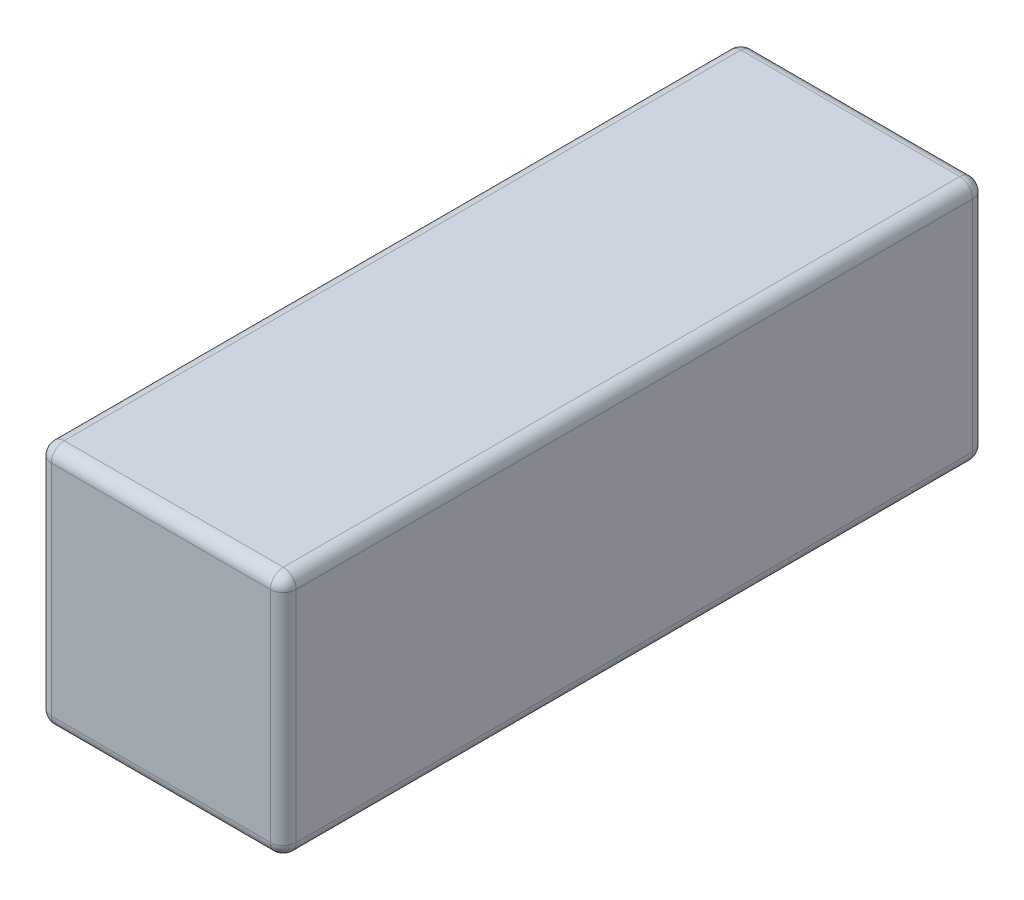
ISO-10303-21;
HEADER;
FILE_DESCRIPTION(('STEP AP214'),'2;1');
FILE_NAME('part.step','',(''),(''),'','','');
FILE_SCHEMA(('AUTOMOTIVE_DESIGN { 1 0 10303 214 1 1 1 1 }'));
ENDSEC;
DATA;
#1=APPLICATION_CONTEXT('core data for automotive mechanical design processes');
#2=APPLICATION_PROTOCOL_DEFINITION('international standard','automotive_design',2000,#1);
#3=PRODUCT_CONTEXT('',#1,'mechanical');
#4=PRODUCT('Part','Part','',(#3));
#5=PRODUCT_RELATED_PRODUCT_CATEGORY('part','',(#4));
#6=PRODUCT_DEFINITION_FORMATION('','',#4);
#7=PRODUCT_DEFINITION_CONTEXT('part definition',#1,'design');
#8=PRODUCT_DEFINITION('design','',#6,#7);
#9=PRODUCT_DEFINITION_SHAPE('','',#8);
#10=(LENGTH_UNIT() NAMED_UNIT(*) SI_UNIT(.MILLI.,.METRE.));
#11=(NAMED_UNIT(*) PLANE_ANGLE_UNIT() SI_UNIT($,.RADIAN.));
#12=(NAMED_UNIT(*) SI_UNIT($,.STERADIAN.) SOLID_ANGLE_UNIT());
#13=UNCERTAINTY_MEASURE_WITH_UNIT(LENGTH_MEASURE(1.E-05),#10,'distance_accuracy_value','');
#14=(GEOMETRIC_REPRESENTATION_CONTEXT(3) GLOBAL_UNCERTAINTY_ASSIGNED_CONTEXT((#13)) GLOBAL_UNIT_ASSIGNED_CONTEXT((#10,
#11,#12)) REPRESENTATION_CONTEXT('',''));
#15=CARTESIAN_POINT('',(0.,0.,0.));
#16=DIRECTION('',(0.,0.,1.));
#17=DIRECTION('',(1.,0.,0.));
#18=AXIS2_PLACEMENT_3D('',#15,#16,#17);
#19=CARTESIAN_POINT('',(-1.4478,-1.4478,73.3679));
#20=DIRECTION('',(1.,0.,0.));
#21=DIRECTION('',(0.,0.,-1.));
#22=AXIS2_PLACEMENT_3D('',#19,#20,#21);
#23=PLANE('',#22);
#24=DIRECTION('',(0.,0.,-1.));
#25=VECTOR('',#24,1.);
#26=CARTESIAN_POINT('',(-1.4478,1.2954,73.3679));
#27=LINE('',#26,#25);
#28=CARTESIAN_POINT('',(-1.4478,1.2954,73.2155));
#29=VERTEX_POINT('',#28);
#30=CARTESIAN_POINT('',(-1.4478,1.2954,65.2145));
#31=VERTEX_POINT('',#30);
#32=EDGE_CURVE('E296',#29,#31,#27,.T.);
#33=ORIENTED_EDGE('',*,*,#32,.T.);
#34=DIRECTION('',(0.,-1.,0.));
#35=VECTOR('',#34,1.);
#36=CARTESIAN_POINT('',(-1.4478,-1.4478,65.2145));
#37=LINE('',#36,#35);
#38=CARTESIAN_POINT('',(-1.4478,-1.2954,65.2145));
#39=VERTEX_POINT('',#38);
#40=EDGE_CURVE('E273',#31,#39,#37,.T.);
#41=ORIENTED_EDGE('',*,*,#40,.T.);
#42=DIRECTION('',(0.,0.,-1.));
#43=VECTOR('',#42,1.);
#44=CARTESIAN_POINT('',(-1.4478,-1.2954,73.3679));
#45=LINE('',#44,#43);
#46=CARTESIAN_POINT('',(-1.4478,-1.2954,73.2155));
#47=VERTEX_POINT('',#46);
#48=EDGE_CURVE('E156',#39,#47,#45,.F.);
#49=ORIENTED_EDGE('',*,*,#48,.T.);
#50=DIRECTION('',(0.,-1.,0.));
#51=VECTOR('',#50,1.);
#52=CARTESIAN_POINT('',(-1.4478,1.2954,73.2155));
#53=LINE('',#52,#51);
#54=EDGE_CURVE('E271',#47,#29,#53,.F.);
#55=ORIENTED_EDGE('',*,*,#54,.T.);
#56=EDGE_LOOP('',(#33,#41,#49,#55));
#57=FACE_BOUND('',#56,.T.);
#58=ADVANCED_FACE('F43',(#57),#23,.F.);
#59=CARTESIAN_POINT('',(1.4478,-1.4478,73.3679));
#60=DIRECTION('',(0.,1.,0.));
#61=DIRECTION('',(-1.,0.,0.));
#62=AXIS2_PLACEMENT_3D('',#59,#60,#61);
#63=PLANE('',#62);
#64=DIRECTION('',(0.,0.,-1.));
#65=VECTOR('',#64,1.);
#66=CARTESIAN_POINT('',(-1.2954,-1.4478,73.3679));
#67=LINE('',#66,#65);
#68=CARTESIAN_POINT('',(-1.2954,-1.4478,73.2155));
#69=VERTEX_POINT('',#68);
#70=CARTESIAN_POINT('',(-1.2954,-1.4478,65.2145));
#71=VERTEX_POINT('',#70);
#72=EDGE_CURVE('E293',#69,#71,#67,.T.);
#73=ORIENTED_EDGE('',*,*,#72,.T.);
#74=DIRECTION('',(1.,0.,0.));
#75=VECTOR('',#74,1.);
#76=CARTESIAN_POINT('',(1.4478,-1.4478,65.2145));
#77=LINE('',#76,#75);
#78=CARTESIAN_POINT('',(1.2954,-1.4478,65.2145));
#79=VERTEX_POINT('',#78);
#80=EDGE_CURVE('E265',#71,#79,#77,.T.);
#81=ORIENTED_EDGE('',*,*,#80,.T.);
#82=DIRECTION('',(0.,0.,-1.));
#83=VECTOR('',#82,1.);
#84=CARTESIAN_POINT('',(1.2954,-1.4478,73.3679));
#85=LINE('',#84,#83);
#86=CARTESIAN_POINT('',(1.2954,-1.4478,73.2155));
#87=VERTEX_POINT('',#86);
#88=EDGE_CURVE('E193',#79,#87,#85,.F.);
#89=ORIENTED_EDGE('',*,*,#88,.T.);
#90=DIRECTION('',(1.,0.,0.));
#91=VECTOR('',#90,1.);
#92=CARTESIAN_POINT('',(-1.2954,-1.4478,73.2155));
#93=LINE('',#92,#91);
#94=EDGE_CURVE('E215',#87,#69,#93,.F.);
#95=ORIENTED_EDGE('',*,*,#94,.T.);
#96=EDGE_LOOP('',(#73,#81,#89,#95));
#97=FACE_BOUND('',#96,.T.);
#98=ADVANCED_FACE('F328',(#97),#63,.F.);
#99=CARTESIAN_POINT('',(1.4478,-1.4478,73.3679));
#100=DIRECTION('',(-1.,0.,0.));
#101=DIRECTION('',(0.,0.,1.));
#102=AXIS2_PLACEMENT_3D('',#99,#100,#101);
#103=PLANE('',#102);
#104=DIRECTION('',(0.,0.,-1.));
#105=VECTOR('',#104,1.);
#106=CARTESIAN_POINT('',(1.4478,-1.2954,73.3679));
#107=LINE('',#106,#105);
#108=CARTESIAN_POINT('',(1.4478,-1.2954,73.2155));
#109=VERTEX_POINT('',#108);
#110=CARTESIAN_POINT('',(1.4478,-1.2954,65.2145));
#111=VERTEX_POINT('',#110);
#112=EDGE_CURVE('E140',#109,#111,#107,.T.);
#113=ORIENTED_EDGE('',*,*,#112,.T.);
#114=DIRECTION('',(0.,1.,0.));
#115=VECTOR('',#114,1.);
#116=CARTESIAN_POINT('',(1.4478,-1.4478,65.2145));
#117=LINE('',#116,#115);
#118=CARTESIAN_POINT('',(1.4478,1.2954,65.2145));
#119=VERTEX_POINT('',#118);
#120=EDGE_CURVE('E134',#111,#119,#117,.T.);
#121=ORIENTED_EDGE('',*,*,#120,.T.);
#122=DIRECTION('',(0.,0.,-1.));
#123=VECTOR('',#122,1.);
#124=CARTESIAN_POINT('',(1.4478,1.2954,73.3679));
#125=LINE('',#124,#123);
#126=CARTESIAN_POINT('',(1.4478,1.2954,73.2155));
#127=VERTEX_POINT('',#126);
#128=EDGE_CURVE('E137',#119,#127,#125,.F.);
#129=ORIENTED_EDGE('',*,*,#128,.T.);
#130=DIRECTION('',(0.,1.,0.));
#131=VECTOR('',#130,1.);
#132=CARTESIAN_POINT('',(1.4478,-1.2954,73.2155));
#133=LINE('',#132,#131);
#134=EDGE_CURVE('E145',#127,#109,#133,.F.);
#135=ORIENTED_EDGE('',*,*,#134,.T.);
#136=EDGE_LOOP('',(#113,#121,#129,#135));
#137=FACE_BOUND('',#136,.T.);
#138=ADVANCED_FACE('F136',(#137),#103,.F.);
#139=CARTESIAN_POINT('',(1.4478,1.4478,73.3679));
#140=DIRECTION('',(0.,-1.,0.));
#141=DIRECTION('',(1.,0.,0.));
#142=AXIS2_PLACEMENT_3D('',#139,#140,#141);
#143=PLANE('',#142);
#144=DIRECTION('',(0.,0.,-1.));
#145=VECTOR('',#144,1.);
#146=CARTESIAN_POINT('',(-1.2954,1.4478,73.3679));
#147=LINE('',#146,#145);
#148=CARTESIAN_POINT('',(-1.2954,1.4478,65.2145));
#149=VERTEX_POINT('',#148);
#150=CARTESIAN_POINT('',(-1.2954,1.4478,73.2155));
#151=VERTEX_POINT('',#150);
#152=EDGE_CURVE('E232',#149,#151,#147,.F.);
#153=ORIENTED_EDGE('',*,*,#152,.T.);
#154=DIRECTION('',(-1.,0.,0.));
#155=VECTOR('',#154,1.);
#156=CARTESIAN_POINT('',(1.2954,1.4478,73.2155));
#157=LINE('',#156,#155);
#158=CARTESIAN_POINT('',(1.2954,1.4478,73.2155));
#159=VERTEX_POINT('',#158);
#160=EDGE_CURVE('E11',#151,#159,#157,.F.);
#161=ORIENTED_EDGE('',*,*,#160,.T.);
#162=DIRECTION('',(0.,0.,-1.));
#163=VECTOR('',#162,1.);
#164=CARTESIAN_POINT('',(1.2954,1.4478,73.3679));
#165=LINE('',#164,#163);
#166=CARTESIAN_POINT('',(1.2954,1.4478,65.2145));
#167=VERTEX_POINT('',#166);
#168=EDGE_CURVE('E233',#159,#167,#165,.T.);
#169=ORIENTED_EDGE('',*,*,#168,.T.);
#170=DIRECTION('',(-1.,0.,0.));
#171=VECTOR('',#170,1.);
#172=CARTESIAN_POINT('',(1.4478,1.4478,65.2145));
#173=LINE('',#172,#171);
#174=EDGE_CURVE('E52',#167,#149,#173,.T.);
#175=ORIENTED_EDGE('',*,*,#174,.T.);
#176=EDGE_LOOP('',(#153,#161,#169,#175));
#177=FACE_BOUND('',#176,.T.);
#178=ADVANCED_FACE('F231',(#177),#143,.F.);
#179=CARTESIAN_POINT('',(0.,0.,73.3679));
#180=DIRECTION('',(0.,0.,1.));
#181=DIRECTION('',(1.,0.,0.));
#182=AXIS2_PLACEMENT_3D('',#179,#180,#181);
#183=PLANE('',#182);
#184=DIRECTION('',(0.,1.,0.));
#185=VECTOR('',#184,1.);
#186=CARTESIAN_POINT('',(1.2954,1.2954,73.3679));
#187=LINE('',#186,#185);
#188=CARTESIAN_POINT('',(1.2954,-1.2954,73.3679));
#189=VERTEX_POINT('',#188);
#190=CARTESIAN_POINT('',(1.2954,1.2954,73.3679));
#191=VERTEX_POINT('',#190);
#192=EDGE_CURVE('E60',#189,#191,#187,.T.);
#193=ORIENTED_EDGE('',*,*,#192,.T.);
#194=DIRECTION('',(-1.,0.,0.));
#195=VECTOR('',#194,1.);
#196=CARTESIAN_POINT('',(-1.2954,1.2954,73.3679));
#197=LINE('',#196,#195);
#198=CARTESIAN_POINT('',(-1.2954,1.2954,73.3679));
#199=VERTEX_POINT('',#198);
#200=EDGE_CURVE('E222',#191,#199,#197,.T.);
#201=ORIENTED_EDGE('',*,*,#200,.T.);
#202=DIRECTION('',(0.,-1.,0.));
#203=VECTOR('',#202,1.);
#204=CARTESIAN_POINT('',(-1.2954,-1.2954,73.3679));
#205=LINE('',#204,#203);
#206=CARTESIAN_POINT('',(-1.2954,-1.2954,73.3679));
#207=VERTEX_POINT('',#206);
#208=EDGE_CURVE('E225',#199,#207,#205,.T.);
#209=ORIENTED_EDGE('',*,*,#208,.T.);
#210=DIRECTION('',(1.,0.,0.));
#211=VECTOR('',#210,1.);
#212=CARTESIAN_POINT('',(1.2954,-1.2954,73.3679));
#213=LINE('',#212,#211);
#214=EDGE_CURVE('E65',#207,#189,#213,.T.);
#215=ORIENTED_EDGE('',*,*,#214,.T.);
#216=EDGE_LOOP('',(#193,#201,#209,#215));
#217=FACE_BOUND('',#216,.T.);
#218=ADVANCED_FACE('F276',(#217),#183,.T.);
#219=CARTESIAN_POINT('',(0.,0.,65.0621));
#220=DIRECTION('',(0.,0.,1.));
#221=DIRECTION('',(1.,0.,0.));
#222=AXIS2_PLACEMENT_3D('',#219,#220,#221);
#223=PLANE('',#222);
#224=DIRECTION('',(-1.,0.,0.));
#225=VECTOR('',#224,1.);
#226=CARTESIAN_POINT('',(0.,1.2954,65.0621));
#227=LINE('',#226,#225);
#228=CARTESIAN_POINT('',(-1.2954,1.2954,65.0621));
#229=VERTEX_POINT('',#228);
#230=CARTESIAN_POINT('',(1.2954,1.2954,65.0621));
#231=VERTEX_POINT('',#230);
#232=EDGE_CURVE('E144',#229,#231,#227,.F.);
#233=ORIENTED_EDGE('',*,*,#232,.T.);
#234=DIRECTION('',(0.,1.,0.));
#235=VECTOR('',#234,1.);
#236=CARTESIAN_POINT('',(1.2954,0.,65.0621));
#237=LINE('',#236,#235);
#238=CARTESIAN_POINT('',(1.2954,-1.2954,65.0621));
#239=VERTEX_POINT('',#238);
#240=EDGE_CURVE('E169',#231,#239,#237,.F.);
#241=ORIENTED_EDGE('',*,*,#240,.T.);
#242=DIRECTION('',(1.,0.,0.));
#243=VECTOR('',#242,1.);
#244=CARTESIAN_POINT('',(0.,-1.2954,65.0621));
#245=LINE('',#244,#243);
#246=CARTESIAN_POINT('',(-1.2954,-1.2954,65.0621));
#247=VERTEX_POINT('',#246);
#248=EDGE_CURVE('E255',#239,#247,#245,.F.);
#249=ORIENTED_EDGE('',*,*,#248,.T.);
#250=DIRECTION('',(0.,-1.,0.));
#251=VECTOR('',#250,1.);
#252=CARTESIAN_POINT('',(-1.2954,0.,65.0621));
#253=LINE('',#252,#251);
#254=EDGE_CURVE('E253',#247,#229,#253,.F.);
#255=ORIENTED_EDGE('',*,*,#254,.T.);
#256=EDGE_LOOP('',(#233,#241,#249,#255));
#257=FACE_BOUND('',#256,.T.);
#258=ADVANCED_FACE('F317',(#257),#223,.F.);
#259=CARTESIAN_POINT('',(-1.2954,-1.2954,73.3679));
#260=DIRECTION('',(0.,0.,-1.));
#261=DIRECTION('',(-1.,0.,0.));
#262=AXIS2_PLACEMENT_3D('',#259,#260,#261);
#263=CYLINDRICAL_SURFACE('',#262,0.1524);
#264=ORIENTED_EDGE('',*,*,#48,.F.);
#265=CARTESIAN_POINT('',(-1.2954,-1.2954,65.2145));
#266=DIRECTION('',(0.,0.,-1.));
#267=DIRECTION('',(-1.,0.,0.));
#268=AXIS2_PLACEMENT_3D('',#265,#266,#267);
#269=CIRCLE('',#268,0.1524);
#270=EDGE_CURVE('E269',#39,#71,#269,.F.);
#271=ORIENTED_EDGE('',*,*,#270,.T.);
#272=ORIENTED_EDGE('',*,*,#72,.F.);
#273=CARTESIAN_POINT('',(-1.2954,-1.2954,73.2155));
#274=DIRECTION('',(0.,0.,-1.));
#275=DIRECTION('',(-1.,0.,0.));
#276=AXIS2_PLACEMENT_3D('',#273,#274,#275);
#277=CIRCLE('',#276,0.1524);
#278=EDGE_CURVE('E267',#69,#47,#277,.T.);
#279=ORIENTED_EDGE('',*,*,#278,.T.);
#280=EDGE_LOOP('',(#264,#271,#272,#279));
#281=FACE_BOUND('',#280,.T.);
#282=ADVANCED_FACE('F290',(#281),#263,.T.);
#283=CARTESIAN_POINT('',(1.2954,-1.2954,73.3679));
#284=DIRECTION('',(0.,0.,-1.));
#285=DIRECTION('',(-1.,0.,0.));
#286=AXIS2_PLACEMENT_3D('',#283,#284,#285);
#287=CYLINDRICAL_SURFACE('',#286,0.1524);
#288=ORIENTED_EDGE('',*,*,#88,.F.);
#289=CARTESIAN_POINT('',(1.2954,-1.2954,65.2145));
#290=DIRECTION('',(0.,0.,-1.));
#291=DIRECTION('',(-1.,0.,0.));
#292=AXIS2_PLACEMENT_3D('',#289,#290,#291);
#293=CIRCLE('',#292,0.1524);
#294=EDGE_CURVE('E262',#79,#111,#293,.F.);
#295=ORIENTED_EDGE('',*,*,#294,.T.);
#296=ORIENTED_EDGE('',*,*,#112,.F.);
#297=CARTESIAN_POINT('',(1.2954,-1.2954,73.2155));
#298=DIRECTION('',(0.,0.,-1.));
#299=DIRECTION('',(-1.,0.,0.));
#300=AXIS2_PLACEMENT_3D('',#297,#298,#299);
#301=CIRCLE('',#300,0.1524);
#302=EDGE_CURVE('E218',#109,#87,#301,.T.);
#303=ORIENTED_EDGE('',*,*,#302,.T.);
#304=EDGE_LOOP('',(#288,#295,#296,#303));
#305=FACE_BOUND('',#304,.T.);
#306=ADVANCED_FACE('F305',(#305),#287,.T.);
#307=CARTESIAN_POINT('',(1.2954,1.2954,73.3679));
#308=DIRECTION('',(0.,0.,-1.));
#309=DIRECTION('',(-1.,0.,0.));
#310=AXIS2_PLACEMENT_3D('',#307,#308,#309);
#311=CYLINDRICAL_SURFACE('',#310,0.1524);
#312=ORIENTED_EDGE('',*,*,#128,.F.);
#313=CARTESIAN_POINT('',(1.2954,1.2954,65.2145));
#314=DIRECTION('',(0.,0.,-1.));
#315=DIRECTION('',(-1.,0.,0.));
#316=AXIS2_PLACEMENT_3D('',#313,#314,#315);
#317=CIRCLE('',#316,0.1524);
#318=EDGE_CURVE('E152',#119,#167,#317,.F.);
#319=ORIENTED_EDGE('',*,*,#318,.T.);
#320=ORIENTED_EDGE('',*,*,#168,.F.);
#321=CARTESIAN_POINT('',(1.2954,1.2954,73.2155));
#322=DIRECTION('',(0.,0.,-1.));
#323=DIRECTION('',(-1.,0.,0.));
#324=AXIS2_PLACEMENT_3D('',#321,#322,#323);
#325=CIRCLE('',#324,0.1524);
#326=EDGE_CURVE('E155',#159,#127,#325,.T.);
#327=ORIENTED_EDGE('',*,*,#326,.T.);
#328=EDGE_LOOP('',(#312,#319,#320,#327));
#329=FACE_BOUND('',#328,.T.);
#330=ADVANCED_FACE('F150',(#329),#311,.T.);
#331=CARTESIAN_POINT('',(-1.2954,1.2954,73.3679));
#332=DIRECTION('',(0.,0.,-1.));
#333=DIRECTION('',(-1.,0.,0.));
#334=AXIS2_PLACEMENT_3D('',#331,#332,#333);
#335=CYLINDRICAL_SURFACE('',#334,0.1524);
#336=ORIENTED_EDGE('',*,*,#152,.F.);
#337=CARTESIAN_POINT('',(-1.2954,1.2954,65.2145));
#338=DIRECTION('',(0.,0.,-1.));
#339=DIRECTION('',(-1.,0.,0.));
#340=AXIS2_PLACEMENT_3D('',#337,#338,#339);
#341=CIRCLE('',#340,0.1524);
#342=EDGE_CURVE('E240',#149,#31,#341,.F.);
#343=ORIENTED_EDGE('',*,*,#342,.T.);
#344=ORIENTED_EDGE('',*,*,#32,.F.);
#345=CARTESIAN_POINT('',(-1.2954,1.2954,73.2155));
#346=DIRECTION('',(0.,0.,-1.));
#347=DIRECTION('',(-1.,0.,0.));
#348=AXIS2_PLACEMENT_3D('',#345,#346,#347);
#349=CIRCLE('',#348,0.1524);
#350=EDGE_CURVE('E243',#29,#151,#349,.T.);
#351=ORIENTED_EDGE('',*,*,#350,.T.);
#352=EDGE_LOOP('',(#336,#343,#344,#351));
#353=FACE_BOUND('',#352,.T.);
#354=ADVANCED_FACE('F238',(#353),#335,.T.);
#355=CARTESIAN_POINT('',(-1.2954,-1.2954,65.2145));
#356=DIRECTION('',(0.,0.,1.));
#357=DIRECTION('',(1.,0.,0.));
#358=AXIS2_PLACEMENT_3D('',#355,#356,#357);
#359=SPHERICAL_SURFACE('',#358,0.1524);
#360=CARTESIAN_POINT('',(-1.2954,-1.2954,65.2145));
#361=DIRECTION('',(1.,0.,0.));
#362=DIRECTION('',(0.,0.,-1.));
#363=AXIS2_PLACEMENT_3D('',#360,#361,#362);
#364=CIRCLE('',#363,0.1524);
#365=EDGE_CURVE('E187',#71,#247,#364,.T.);
#366=ORIENTED_EDGE('',*,*,#365,.F.);
#367=ORIENTED_EDGE('',*,*,#270,.F.);
#368=CARTESIAN_POINT('',(-1.2954,-1.2954,65.2145));
#369=DIRECTION('',(0.,1.,0.));
#370=DIRECTION('',(0.,0.,1.));
#371=AXIS2_PLACEMENT_3D('',#368,#369,#370);
#372=CIRCLE('',#371,0.1524);
#373=EDGE_CURVE('E190',#247,#39,#372,.T.);
#374=ORIENTED_EDGE('',*,*,#373,.F.);
#375=EDGE_LOOP('',(#366,#367,#374));
#376=FACE_BOUND('',#375,.T.);
#377=ADVANCED_FACE('F343',(#376),#359,.T.);
#378=CARTESIAN_POINT('',(-1.2954,-1.4478,65.2145));
#379=DIRECTION('',(0.,-1.,0.));
#380=DIRECTION('',(0.,0.,-1.));
#381=AXIS2_PLACEMENT_3D('',#378,#379,#380);
#382=CYLINDRICAL_SURFACE('',#381,0.1524);
#383=ORIENTED_EDGE('',*,*,#373,.T.);
#384=ORIENTED_EDGE('',*,*,#40,.F.);
#385=CARTESIAN_POINT('',(-1.2954,1.2954,65.2145));
#386=DIRECTION('',(0.,1.,0.));
#387=DIRECTION('',(0.,0.,1.));
#388=AXIS2_PLACEMENT_3D('',#385,#386,#387);
#389=CIRCLE('',#388,0.1524);
#390=EDGE_CURVE('E184',#229,#31,#389,.T.);
#391=ORIENTED_EDGE('',*,*,#390,.F.);
#392=ORIENTED_EDGE('',*,*,#254,.F.);
#393=EDGE_LOOP('',(#383,#384,#391,#392));
#394=FACE_BOUND('',#393,.T.);
#395=ADVANCED_FACE('F356',(#394),#382,.T.);
#396=CARTESIAN_POINT('',(1.4478,-1.2954,65.2145));
#397=DIRECTION('',(1.,0.,0.));
#398=DIRECTION('',(0.,1.,0.));
#399=AXIS2_PLACEMENT_3D('',#396,#397,#398);
#400=CYLINDRICAL_SURFACE('',#399,0.1524);
#401=ORIENTED_EDGE('',*,*,#365,.T.);
#402=ORIENTED_EDGE('',*,*,#248,.F.);
#403=CARTESIAN_POINT('',(1.2954,-1.2954,65.2145));
#404=DIRECTION('',(1.,0.,0.));
#405=DIRECTION('',(0.,0.,-1.));
#406=AXIS2_PLACEMENT_3D('',#403,#404,#405);
#407=CIRCLE('',#406,0.1524);
#408=EDGE_CURVE('E181',#79,#239,#407,.T.);
#409=ORIENTED_EDGE('',*,*,#408,.F.);
#410=ORIENTED_EDGE('',*,*,#80,.F.);
#411=EDGE_LOOP('',(#401,#402,#409,#410));
#412=FACE_BOUND('',#411,.T.);
#413=ADVANCED_FACE('F314',(#412),#400,.T.);
#414=CARTESIAN_POINT('',(-1.2954,1.2954,65.2145));
#415=DIRECTION('',(0.,0.,1.));
#416=DIRECTION('',(1.,0.,0.));
#417=AXIS2_PLACEMENT_3D('',#414,#415,#416);
#418=SPHERICAL_SURFACE('',#417,0.1524);
#419=ORIENTED_EDGE('',*,*,#390,.T.);
#420=ORIENTED_EDGE('',*,*,#342,.F.);
#421=CARTESIAN_POINT('',(-1.2954,1.2954,65.2145));
#422=DIRECTION('',(1.,0.,0.));
#423=DIRECTION('',(0.,0.,-1.));
#424=AXIS2_PLACEMENT_3D('',#421,#422,#423);
#425=CIRCLE('',#424,0.1524);
#426=EDGE_CURVE('E178',#229,#149,#425,.T.);
#427=ORIENTED_EDGE('',*,*,#426,.F.);
#428=EDGE_LOOP('',(#419,#420,#427));
#429=FACE_BOUND('',#428,.T.);
#430=ADVANCED_FACE('F247',(#429),#418,.T.);
#431=CARTESIAN_POINT('',(1.2954,-1.2954,65.2145));
#432=DIRECTION('',(0.,0.,1.));
#433=DIRECTION('',(1.,0.,0.));
#434=AXIS2_PLACEMENT_3D('',#431,#432,#433);
#435=SPHERICAL_SURFACE('',#434,0.1524);
#436=ORIENTED_EDGE('',*,*,#294,.F.);
#437=ORIENTED_EDGE('',*,*,#408,.T.);
#438=CARTESIAN_POINT('',(1.2954,-1.2954,65.2145));
#439=DIRECTION('',(0.,1.,0.));
#440=DIRECTION('',(0.,0.,1.));
#441=AXIS2_PLACEMENT_3D('',#438,#439,#440);
#442=CIRCLE('',#441,0.1524);
#443=EDGE_CURVE('E171',#111,#239,#442,.T.);
#444=ORIENTED_EDGE('',*,*,#443,.F.);
#445=EDGE_LOOP('',(#436,#437,#444));
#446=FACE_BOUND('',#445,.T.);
#447=ADVANCED_FACE('F310',(#446),#435,.T.);
#448=CARTESIAN_POINT('',(1.4478,1.2954,65.2145));
#449=DIRECTION('',(-1.,0.,0.));
#450=DIRECTION('',(0.,-1.,0.));
#451=AXIS2_PLACEMENT_3D('',#448,#449,#450);
#452=CYLINDRICAL_SURFACE('',#451,0.1524);
#453=ORIENTED_EDGE('',*,*,#426,.T.);
#454=ORIENTED_EDGE('',*,*,#174,.F.);
#455=CARTESIAN_POINT('',(1.2954,1.2954,65.2145));
#456=DIRECTION('',(1.,0.,0.));
#457=DIRECTION('',(0.,0.,-1.));
#458=AXIS2_PLACEMENT_3D('',#455,#456,#457);
#459=CIRCLE('',#458,0.1524);
#460=EDGE_CURVE('E163',#231,#167,#459,.T.);
#461=ORIENTED_EDGE('',*,*,#460,.F.);
#462=ORIENTED_EDGE('',*,*,#232,.F.);
#463=EDGE_LOOP('',(#453,#454,#461,#462));
#464=FACE_BOUND('',#463,.T.);
#465=ADVANCED_FACE('F251',(#464),#452,.T.);
#466=CARTESIAN_POINT('',(1.2954,-1.4478,65.2145));
#467=DIRECTION('',(0.,1.,0.));
#468=DIRECTION('',(0.,0.,1.));
#469=AXIS2_PLACEMENT_3D('',#466,#467,#468);
#470=CYLINDRICAL_SURFACE('',#469,0.1524);
#471=ORIENTED_EDGE('',*,*,#443,.T.);
#472=ORIENTED_EDGE('',*,*,#240,.F.);
#473=CARTESIAN_POINT('',(1.2954,1.2954,65.2145));
#474=DIRECTION('',(0.,1.,0.));
#475=DIRECTION('',(0.,0.,1.));
#476=AXIS2_PLACEMENT_3D('',#473,#474,#475);
#477=CIRCLE('',#476,0.1524);
#478=EDGE_CURVE('E161',#119,#231,#477,.T.);
#479=ORIENTED_EDGE('',*,*,#478,.F.);
#480=ORIENTED_EDGE('',*,*,#120,.F.);
#481=EDGE_LOOP('',(#471,#472,#479,#480));
#482=FACE_BOUND('',#481,.T.);
#483=ADVANCED_FACE('F167',(#482),#470,.T.);
#484=CARTESIAN_POINT('',(1.2954,1.2954,65.2145));
#485=DIRECTION('',(0.,0.,1.));
#486=DIRECTION('',(1.,0.,0.));
#487=AXIS2_PLACEMENT_3D('',#484,#485,#486);
#488=SPHERICAL_SURFACE('',#487,0.1524);
#489=ORIENTED_EDGE('',*,*,#460,.T.);
#490=ORIENTED_EDGE('',*,*,#318,.F.);
#491=ORIENTED_EDGE('',*,*,#478,.T.);
#492=EDGE_LOOP('',(#489,#490,#491));
#493=FACE_BOUND('',#492,.T.);
#494=ADVANCED_FACE('F160',(#493),#488,.T.);
#495=CARTESIAN_POINT('',(1.2954,-1.2954,73.2155));
#496=DIRECTION('',(0.,0.,1.));
#497=DIRECTION('',(1.,0.,0.));
#498=AXIS2_PLACEMENT_3D('',#495,#496,#497);
#499=SPHERICAL_SURFACE('',#498,0.1524);
#500=CARTESIAN_POINT('',(1.2954,-1.2954,73.2155));
#501=DIRECTION('',(-1.,0.,0.));
#502=DIRECTION('',(0.,0.,1.));
#503=AXIS2_PLACEMENT_3D('',#500,#501,#502);
#504=CIRCLE('',#503,0.1524);
#505=EDGE_CURVE('E174',#87,#189,#504,.T.);
#506=ORIENTED_EDGE('',*,*,#505,.F.);
#507=ORIENTED_EDGE('',*,*,#302,.F.);
#508=CARTESIAN_POINT('',(1.2954,-1.2954,73.2155));
#509=DIRECTION('',(0.,1.,0.));
#510=DIRECTION('',(0.,0.,1.));
#511=AXIS2_PLACEMENT_3D('',#508,#509,#510);
#512=CIRCLE('',#511,0.1524);
#513=EDGE_CURVE('E47',#189,#109,#512,.T.);
#514=ORIENTED_EDGE('',*,*,#513,.F.);
#515=EDGE_LOOP('',(#506,#507,#514));
#516=FACE_BOUND('',#515,.T.);
#517=ADVANCED_FACE('F45',(#516),#499,.T.);
#518=CARTESIAN_POINT('',(1.2954,0.,73.2155));
#519=DIRECTION('',(0.,-1.,0.));
#520=DIRECTION('',(0.,0.,-1.));
#521=AXIS2_PLACEMENT_3D('',#518,#519,#520);
#522=CYLINDRICAL_SURFACE('',#521,0.1524);
#523=ORIENTED_EDGE('',*,*,#513,.T.);
#524=ORIENTED_EDGE('',*,*,#134,.F.);
#525=CARTESIAN_POINT('',(1.2954,1.2954,73.2155));
#526=DIRECTION('',(0.,1.,0.));
#527=DIRECTION('',(-1.,0.,0.));
#528=AXIS2_PLACEMENT_3D('',#525,#526,#527);
#529=CIRCLE('',#528,0.1524);
#530=EDGE_CURVE('E207',#191,#127,#529,.T.);
#531=ORIENTED_EDGE('',*,*,#530,.F.);
#532=ORIENTED_EDGE('',*,*,#192,.F.);
#533=EDGE_LOOP('',(#523,#524,#531,#532));
#534=FACE_BOUND('',#533,.T.);
#535=ADVANCED_FACE('F220',(#534),#522,.T.);
#536=CARTESIAN_POINT('',(0.,-1.2954,73.2155));
#537=DIRECTION('',(-1.,0.,0.));
#538=DIRECTION('',(0.,-1.,0.));
#539=AXIS2_PLACEMENT_3D('',#536,#537,#538);
#540=CYLINDRICAL_SURFACE('',#539,0.1524);
#541=ORIENTED_EDGE('',*,*,#505,.T.);
#542=ORIENTED_EDGE('',*,*,#214,.F.);
#543=CARTESIAN_POINT('',(-1.2954,-1.2954,73.2155));
#544=DIRECTION('',(-1.,0.,0.));
#545=DIRECTION('',(0.,0.,1.));
#546=AXIS2_PLACEMENT_3D('',#543,#544,#545);
#547=CIRCLE('',#546,0.1524);
#548=EDGE_CURVE('E204',#69,#207,#547,.T.);
#549=ORIENTED_EDGE('',*,*,#548,.F.);
#550=ORIENTED_EDGE('',*,*,#94,.F.);
#551=EDGE_LOOP('',(#541,#542,#549,#550));
#552=FACE_BOUND('',#551,.T.);
#553=ADVANCED_FACE('F213',(#552),#540,.T.);
#554=CARTESIAN_POINT('',(1.2954,1.2954,73.2155));
#555=DIRECTION('',(0.,0.,1.));
#556=DIRECTION('',(1.,0.,0.));
#557=AXIS2_PLACEMENT_3D('',#554,#555,#556);
#558=SPHERICAL_SURFACE('',#557,0.1524);
#559=ORIENTED_EDGE('',*,*,#530,.T.);
#560=ORIENTED_EDGE('',*,*,#326,.F.);
#561=CARTESIAN_POINT('',(1.2954,1.2954,73.2155));
#562=DIRECTION('',(-1.,0.,0.));
#563=DIRECTION('',(0.,0.,1.));
#564=AXIS2_PLACEMENT_3D('',#561,#562,#563);
#565=CIRCLE('',#564,0.1524);
#566=EDGE_CURVE('E201',#191,#159,#565,.T.);
#567=ORIENTED_EDGE('',*,*,#566,.F.);
#568=EDGE_LOOP('',(#559,#560,#567));
#569=FACE_BOUND('',#568,.T.);
#570=ADVANCED_FACE('F375',(#569),#558,.T.);
#571=CARTESIAN_POINT('',(-1.2954,-1.2954,73.2155));
#572=DIRECTION('',(0.,0.,1.));
#573=DIRECTION('',(1.,0.,0.));
#574=AXIS2_PLACEMENT_3D('',#571,#572,#573);
#575=SPHERICAL_SURFACE('',#574,0.1524);
#576=ORIENTED_EDGE('',*,*,#278,.F.);
#577=ORIENTED_EDGE('',*,*,#548,.T.);
#578=CARTESIAN_POINT('',(-1.2954,-1.2954,73.2155));
#579=DIRECTION('',(0.,1.,0.));
#580=DIRECTION('',(0.,0.,1.));
#581=AXIS2_PLACEMENT_3D('',#578,#579,#580);
#582=CIRCLE('',#581,0.1524);
#583=EDGE_CURVE('E198',#47,#207,#582,.T.);
#584=ORIENTED_EDGE('',*,*,#583,.F.);
#585=EDGE_LOOP('',(#576,#577,#584));
#586=FACE_BOUND('',#585,.T.);
#587=ADVANCED_FACE('F285',(#586),#575,.T.);
#588=CARTESIAN_POINT('',(0.,1.2954,73.2155));
#589=DIRECTION('',(1.,0.,0.));
#590=DIRECTION('',(0.,1.,0.));
#591=AXIS2_PLACEMENT_3D('',#588,#589,#590);
#592=CYLINDRICAL_SURFACE('',#591,0.1524);
#593=ORIENTED_EDGE('',*,*,#566,.T.);
#594=ORIENTED_EDGE('',*,*,#160,.F.);
#595=CARTESIAN_POINT('',(-1.2954,1.2954,73.2155));
#596=DIRECTION('',(-1.,0.,0.));
#597=DIRECTION('',(0.,0.,1.));
#598=AXIS2_PLACEMENT_3D('',#595,#596,#597);
#599=CIRCLE('',#598,0.1524);
#600=EDGE_CURVE('E196',#199,#151,#599,.T.);
#601=ORIENTED_EDGE('',*,*,#600,.F.);
#602=ORIENTED_EDGE('',*,*,#200,.F.);
#603=EDGE_LOOP('',(#593,#594,#601,#602));
#604=FACE_BOUND('',#603,.T.);
#605=ADVANCED_FACE('F369',(#604),#592,.T.);
#606=CARTESIAN_POINT('',(-1.2954,0.,73.2155));
#607=DIRECTION('',(0.,1.,0.));
#608=DIRECTION('',(0.,0.,1.));
#609=AXIS2_PLACEMENT_3D('',#606,#607,#608);
#610=CYLINDRICAL_SURFACE('',#609,0.1524);
#611=ORIENTED_EDGE('',*,*,#583,.T.);
#612=ORIENTED_EDGE('',*,*,#208,.F.);
#613=CARTESIAN_POINT('',(-1.2954,1.2954,73.2155));
#614=DIRECTION('',(0.,1.,0.));
#615=DIRECTION('',(0.,0.,1.));
#616=AXIS2_PLACEMENT_3D('',#613,#614,#615);
#617=CIRCLE('',#616,0.1524);
#618=EDGE_CURVE('E194',#29,#199,#617,.T.);
#619=ORIENTED_EDGE('',*,*,#618,.F.);
#620=ORIENTED_EDGE('',*,*,#54,.F.);
#621=EDGE_LOOP('',(#611,#612,#619,#620));
#622=FACE_BOUND('',#621,.T.);
#623=ADVANCED_FACE('F280',(#622),#610,.T.);
#624=CARTESIAN_POINT('',(-1.2954,1.2954,73.2155));
#625=DIRECTION('',(0.,0.,1.));
#626=DIRECTION('',(1.,0.,0.));
#627=AXIS2_PLACEMENT_3D('',#624,#625,#626);
#628=SPHERICAL_SURFACE('',#627,0.1524);
#629=ORIENTED_EDGE('',*,*,#600,.T.);
#630=ORIENTED_EDGE('',*,*,#350,.F.);
#631=ORIENTED_EDGE('',*,*,#618,.T.);
#632=EDGE_LOOP('',(#629,#630,#631));
#633=FACE_BOUND('',#632,.T.);
#634=ADVANCED_FACE('F363',(#633),#628,.T.);
#635=CLOSED_SHELL('',(#58,#98,#138,#178,#218,#258,#282,#306,#330,#354,#377,#395,#413,#430,#447,
#465,#483,#494,#517,#535,#553,#570,#587,#605,#623,#634));
#636=MANIFOLD_SOLID_BREP('B2',#635);
#637=ADVANCED_BREP_SHAPE_REPRESENTATION('',(#18,#636),#14);
#638=SHAPE_DEFINITION_REPRESENTATION(#9,#637);
ENDSEC;
END-ISO-10303-21;
